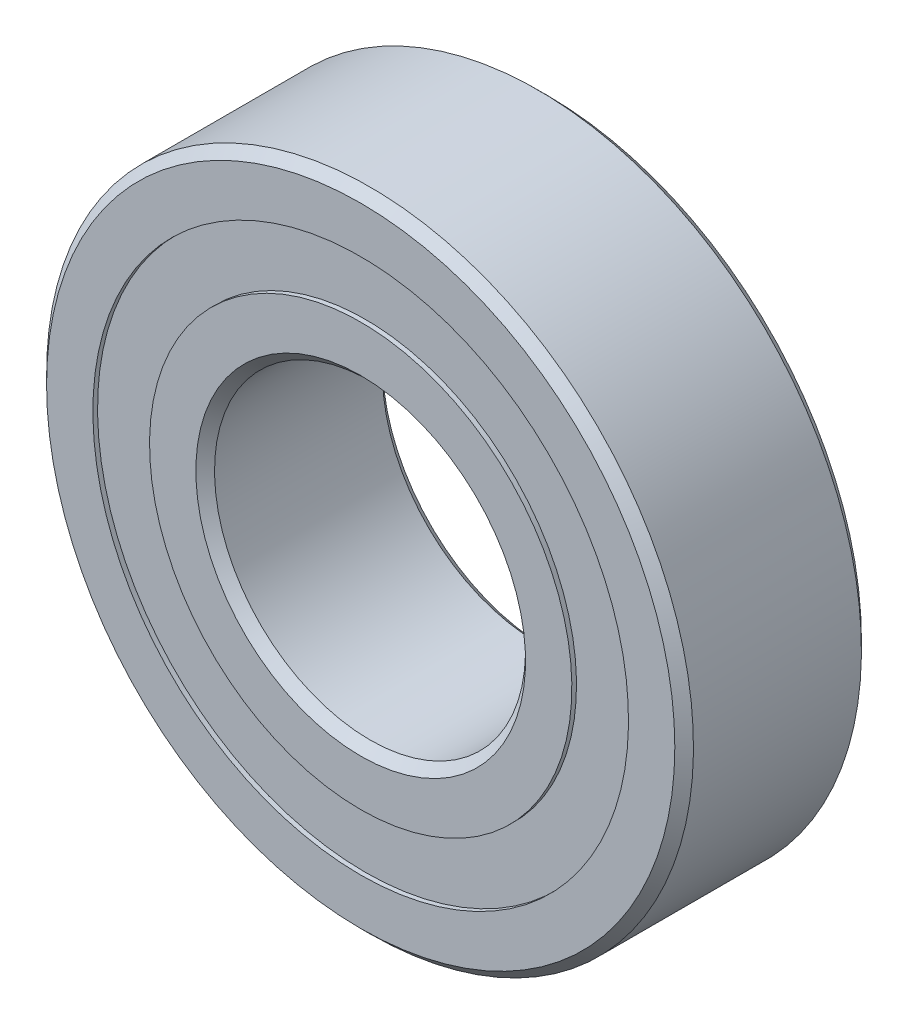
ISO-10303-21;
HEADER;
FILE_DESCRIPTION(('STEP AP214'),'2;1');
FILE_NAME('part.step','',(''),(''),'','','');
FILE_SCHEMA(('AUTOMOTIVE_DESIGN { 1 0 10303 214 1 1 1 1 }'));
ENDSEC;
DATA;
#1=APPLICATION_CONTEXT('core data for automotive mechanical design processes');
#2=APPLICATION_PROTOCOL_DEFINITION('international standard','automotive_design',2000,#1);
#3=PRODUCT_CONTEXT('',#1,'mechanical');
#4=PRODUCT('Part','Part','',(#3));
#5=PRODUCT_RELATED_PRODUCT_CATEGORY('part','',(#4));
#6=PRODUCT_DEFINITION_FORMATION('','',#4);
#7=PRODUCT_DEFINITION_CONTEXT('part definition',#1,'design');
#8=PRODUCT_DEFINITION('design','',#6,#7);
#9=PRODUCT_DEFINITION_SHAPE('','',#8);
#10=(LENGTH_UNIT() NAMED_UNIT(*) SI_UNIT(.MILLI.,.METRE.));
#11=(NAMED_UNIT(*) PLANE_ANGLE_UNIT() SI_UNIT($,.RADIAN.));
#12=(NAMED_UNIT(*) SI_UNIT($,.STERADIAN.) SOLID_ANGLE_UNIT());
#13=UNCERTAINTY_MEASURE_WITH_UNIT(LENGTH_MEASURE(1.E-05),#10,'distance_accuracy_value','');
#14=(GEOMETRIC_REPRESENTATION_CONTEXT(3) GLOBAL_UNCERTAINTY_ASSIGNED_CONTEXT((#13)) GLOBAL_UNIT_ASSIGNED_CONTEXT((#10,
#11,#12)) REPRESENTATION_CONTEXT('',''));
#15=CARTESIAN_POINT('',(0.,0.,0.));
#16=DIRECTION('',(0.,0.,1.));
#17=DIRECTION('',(1.,0.,0.));
#18=AXIS2_PLACEMENT_3D('',#15,#16,#17);
#19=CARTESIAN_POINT('',(0.,21.5269230769231,-7.125));
#20=DIRECTION('',(0.,0.,1.));
#21=DIRECTION('',(0.,-1.,0.));
#22=AXIS2_PLACEMENT_3D('',#19,#20,#21);
#23=PLANE('',#22);
#24=CARTESIAN_POINT('',(0.,0.,-7.125));
#25=DIRECTION('',(0.,0.,1.));
#26=DIRECTION('',(0.,-1.,0.));
#27=AXIS2_PLACEMENT_3D('',#24,#25,#26);
#28=CIRCLE('',#27,21.5269230769231);
#29=CARTESIAN_POINT('',(0.,-21.5269230769231,-7.12500000000001));
#30=VERTEX_POINT('',#29);
#31=EDGE_CURVE('E57',#30,#30,#28,.T.);
#32=ORIENTED_EDGE('',*,*,#31,.F.);
#33=EDGE_LOOP('',(#32));
#34=FACE_BOUND('',#33,.T.);
#35=CARTESIAN_POINT('',(0.,0.,-7.125));
#36=DIRECTION('',(0.,0.,1.));
#37=DIRECTION('',(0.,-1.,0.));
#38=AXIS2_PLACEMENT_3D('',#35,#36,#37);
#39=CIRCLE('',#38,16.9730769230769);
#40=CARTESIAN_POINT('',(0.,-16.9730769230769,-7.12500000000001));
#41=VERTEX_POINT('',#40);
#42=EDGE_CURVE('E11',#41,#41,#39,.T.);
#43=ORIENTED_EDGE('',*,*,#42,.T.);
#44=EDGE_LOOP('',(#43));
#45=FACE_BOUND('',#44,.T.);
#46=ADVANCED_FACE('F43',(#34,#45),#23,.F.);
#47=CARTESIAN_POINT('',(0.,0.,7.5));
#48=DIRECTION('',(0.,0.,1.));
#49=DIRECTION('',(0.,-1.,0.));
#50=AXIS2_PLACEMENT_3D('',#47,#48,#49);
#51=CYLINDRICAL_SURFACE('',#50,16.9730769230769);
#52=ORIENTED_EDGE('',*,*,#42,.F.);
#53=EDGE_LOOP('',(#52));
#54=FACE_BOUND('',#53,.T.);
#55=CARTESIAN_POINT('',(0.,0.,-4.03676724735722));
#56=DIRECTION('',(0.,0.,1.));
#57=DIRECTION('',(0.,-1.,0.));
#58=AXIS2_PLACEMENT_3D('',#55,#56,#57);
#59=CIRCLE('',#58,16.9730769230769);
#60=CARTESIAN_POINT('',(0.,-16.9730769230769,-4.03676724735722));
#61=VERTEX_POINT('',#60);
#62=EDGE_CURVE('E49',#61,#61,#59,.T.);
#63=ORIENTED_EDGE('',*,*,#62,.T.);
#64=EDGE_LOOP('',(#63));
#65=FACE_BOUND('',#64,.T.);
#66=ADVANCED_FACE('F66',(#54,#65),#51,.F.);
#67=CARTESIAN_POINT('',(0.,21.5269230769231,-4.03676724735722));
#68=DIRECTION('',(0.,0.,-1.));
#69=DIRECTION('',(0.,1.,0.));
#70=AXIS2_PLACEMENT_3D('',#67,#68,#69);
#71=PLANE('',#70);
#72=ORIENTED_EDGE('',*,*,#62,.F.);
#73=EDGE_LOOP('',(#72));
#74=FACE_BOUND('',#73,.T.);
#75=CARTESIAN_POINT('',(0.,0.,-4.03676724735722));
#76=DIRECTION('',(0.,0.,1.));
#77=DIRECTION('',(0.,-1.,0.));
#78=AXIS2_PLACEMENT_3D('',#75,#76,#77);
#79=CIRCLE('',#78,21.5269230769231);
#80=CARTESIAN_POINT('',(0.,-21.5269230769231,-4.03676724735723));
#81=VERTEX_POINT('',#80);
#82=EDGE_CURVE('E53',#81,#81,#79,.T.);
#83=ORIENTED_EDGE('',*,*,#82,.T.);
#84=EDGE_LOOP('',(#83));
#85=FACE_BOUND('',#84,.T.);
#86=ADVANCED_FACE('F70',(#74,#85),#71,.F.);
#87=CARTESIAN_POINT('',(0.,0.,7.5));
#88=DIRECTION('',(0.,0.,1.));
#89=DIRECTION('',(0.,-1.,0.));
#90=AXIS2_PLACEMENT_3D('',#87,#88,#89);
#91=CYLINDRICAL_SURFACE('',#90,21.5269230769231);
#92=ORIENTED_EDGE('',*,*,#82,.F.);
#93=EDGE_LOOP('',(#92));
#94=FACE_BOUND('',#93,.T.);
#95=ORIENTED_EDGE('',*,*,#31,.T.);
#96=EDGE_LOOP('',(#95));
#97=FACE_BOUND('',#96,.T.);
#98=ADVANCED_FACE('F63',(#94,#97),#91,.T.);
#99=CLOSED_SHELL('',(#46,#66,#86,#98));
#100=MANIFOLD_SOLID_BREP('B2',#99);
#101=CARTESIAN_POINT('',(0.,21.5269230769231,7.125));
#102=DIRECTION('',(0.,0.,-1.));
#103=DIRECTION('',(0.,1.,0.));
#104=AXIS2_PLACEMENT_3D('',#101,#102,#103);
#105=PLANE('',#104);
#106=CARTESIAN_POINT('',(0.,0.,7.125));
#107=DIRECTION('',(0.,0.,1.));
#108=DIRECTION('',(0.,-1.,0.));
#109=AXIS2_PLACEMENT_3D('',#106,#107,#108);
#110=CIRCLE('',#109,16.9730769230769);
#111=CARTESIAN_POINT('',(0.,-16.9730769230769,7.12499999999999));
#112=VERTEX_POINT('',#111);
#113=EDGE_CURVE('E42',#112,#112,#110,.T.);
#114=ORIENTED_EDGE('',*,*,#113,.F.);
#115=EDGE_LOOP('',(#114));
#116=FACE_BOUND('',#115,.T.);
#117=CARTESIAN_POINT('',(0.,0.,7.125));
#118=DIRECTION('',(0.,0.,1.));
#119=DIRECTION('',(0.,-1.,0.));
#120=AXIS2_PLACEMENT_3D('',#117,#118,#119);
#121=CIRCLE('',#120,21.5269230769231);
#122=CARTESIAN_POINT('',(0.,-21.5269230769231,7.12499999999999));
#123=VERTEX_POINT('',#122);
#124=EDGE_CURVE('E138',#123,#123,#121,.T.);
#125=ORIENTED_EDGE('',*,*,#124,.T.);
#126=EDGE_LOOP('',(#125));
#127=FACE_BOUND('',#126,.T.);
#128=ADVANCED_FACE('F124',(#116,#127),#105,.F.);
#129=CARTESIAN_POINT('',(0.,0.,7.5));
#130=DIRECTION('',(0.,0.,1.));
#131=DIRECTION('',(0.,-1.,0.));
#132=AXIS2_PLACEMENT_3D('',#129,#130,#131);
#133=CYLINDRICAL_SURFACE('',#132,16.9730769230769);
#134=CARTESIAN_POINT('',(0.,0.,4.03676724735722));
#135=DIRECTION('',(0.,0.,1.));
#136=DIRECTION('',(0.,-1.,0.));
#137=AXIS2_PLACEMENT_3D('',#134,#135,#136);
#138=CIRCLE('',#137,16.9730769230769);
#139=CARTESIAN_POINT('',(0.,-16.9730769230769,4.03676724735721));
#140=VERTEX_POINT('',#139);
#141=EDGE_CURVE('E130',#140,#140,#138,.T.);
#142=ORIENTED_EDGE('',*,*,#141,.F.);
#143=EDGE_LOOP('',(#142));
#144=FACE_BOUND('',#143,.T.);
#145=ORIENTED_EDGE('',*,*,#113,.T.);
#146=EDGE_LOOP('',(#145));
#147=FACE_BOUND('',#146,.T.);
#148=ADVANCED_FACE('F153',(#144,#147),#133,.F.);
#149=CARTESIAN_POINT('',(0.,21.5269230769231,4.03676724735722));
#150=DIRECTION('',(0.,0.,1.));
#151=DIRECTION('',(0.,-1.,0.));
#152=AXIS2_PLACEMENT_3D('',#149,#150,#151);
#153=PLANE('',#152);
#154=CARTESIAN_POINT('',(0.,0.,4.03676724735722));
#155=DIRECTION('',(0.,0.,1.));
#156=DIRECTION('',(0.,-1.,0.));
#157=AXIS2_PLACEMENT_3D('',#154,#155,#156);
#158=CIRCLE('',#157,21.5269230769231);
#159=CARTESIAN_POINT('',(0.,-21.5269230769231,4.03676724735721));
#160=VERTEX_POINT('',#159);
#161=EDGE_CURVE('E134',#160,#160,#158,.T.);
#162=ORIENTED_EDGE('',*,*,#161,.F.);
#163=EDGE_LOOP('',(#162));
#164=FACE_BOUND('',#163,.T.);
#165=ORIENTED_EDGE('',*,*,#141,.T.);
#166=EDGE_LOOP('',(#165));
#167=FACE_BOUND('',#166,.T.);
#168=ADVANCED_FACE('F148',(#164,#167),#153,.F.);
#169=CARTESIAN_POINT('',(0.,0.,7.5));
#170=DIRECTION('',(0.,0.,1.));
#171=DIRECTION('',(0.,-1.,0.));
#172=AXIS2_PLACEMENT_3D('',#169,#170,#171);
#173=CYLINDRICAL_SURFACE('',#172,21.5269230769231);
#174=ORIENTED_EDGE('',*,*,#124,.F.);
#175=EDGE_LOOP('',(#174));
#176=FACE_BOUND('',#175,.T.);
#177=ORIENTED_EDGE('',*,*,#161,.T.);
#178=EDGE_LOOP('',(#177));
#179=FACE_BOUND('',#178,.T.);
#180=ADVANCED_FACE('F145',(#176,#179),#173,.T.);
#181=CLOSED_SHELL('',(#128,#148,#168,#180));
#182=MANIFOLD_SOLID_BREP('B6',#181);
#183=CARTESIAN_POINT('',(-12.3736614864657,14.7463555300405,0.));
#184=DIRECTION('',(0.,0.,1.));
#185=DIRECTION('',(-0.64278760968653,0.766044443118986,0.));
#186=AXIS2_PLACEMENT_3D('',#183,#184,#185);
#187=SPHERICAL_SURFACE('',#186,4.03676724735722);
#188=CARTESIAN_POINT('',(-12.3736614864657,14.7463555300405,4.03676724735722));
#189=VERTEX_POINT('',#188);
#190=VERTEX_LOOP('',#189);
#191=FACE_BOUND('',#190,.T.);
#192=ADVANCED_FACE('F205',(#191),#187,.T.);
#193=CLOSED_SHELL('',(#192));
#194=MANIFOLD_SOLID_BREP('B37',#193);
#195=CARTESIAN_POINT('',(-18.957549245485,3.3427274200886,0.));
#196=DIRECTION('',(0.,0.,1.));
#197=DIRECTION('',(-0.984807753012206,0.17364817766694,0.));
#198=AXIS2_PLACEMENT_3D('',#195,#196,#197);
#199=SPHERICAL_SURFACE('',#198,4.03676724735722);
#200=CARTESIAN_POINT('',(-18.957549245485,3.3427274200886,4.03676724735722));
#201=VERTEX_POINT('',#200);
#202=VERTEX_LOOP('',#201);
#203=FACE_BOUND('',#202,.T.);
#204=ADVANCED_FACE('F223',(#203),#199,.T.);
#205=CLOSED_SHELL('',(#204));
#206=MANIFOLD_SOLID_BREP('B120',#205);
#207=CARTESIAN_POINT('',(-16.6709890228505,-9.62499999999985,0.));
#208=DIRECTION('',(0.,0.,1.));
#209=DIRECTION('',(-0.866025403784443,-0.499999999999992,0.));
#210=AXIS2_PLACEMENT_3D('',#207,#208,#209);
#211=SPHERICAL_SURFACE('',#210,4.03676724735722);
#212=CARTESIAN_POINT('',(-16.6709890228505,-9.62499999999985,4.03676724735721));
#213=VERTEX_POINT('',#212);
#214=VERTEX_LOOP('',#213);
#215=FACE_BOUND('',#214,.T.);
#216=ADVANCED_FACE('F241',(#215),#211,.T.);
#217=CLOSED_SHELL('',(#216));
#218=MANIFOLD_SOLID_BREP('B201',#217);
#219=CARTESIAN_POINT('',(-6.58388775901926,-18.0890829501287,0.));
#220=DIRECTION('',(0.,0.,1.));
#221=DIRECTION('',(-0.342020143325676,-0.939692620785906,0.));
#222=AXIS2_PLACEMENT_3D('',#219,#220,#221);
#223=SPHERICAL_SURFACE('',#222,4.03676724735722);
#224=CARTESIAN_POINT('',(-6.58388775901926,-18.0890829501287,4.03676724735721));
#225=VERTEX_POINT('',#224);
#226=VERTEX_LOOP('',#225);
#227=FACE_BOUND('',#226,.T.);
#228=ADVANCED_FACE('F259',(#227),#223,.T.);
#229=CLOSED_SHELL('',(#228));
#230=MANIFOLD_SOLID_BREP('B219',#229);
#231=CARTESIAN_POINT('',(6.58388775901902,-18.0890829501288,0.));
#232=DIRECTION('',(0.,0.,1.));
#233=DIRECTION('',(0.342020143325663,-0.939692620785911,0.));
#234=AXIS2_PLACEMENT_3D('',#231,#232,#233);
#235=SPHERICAL_SURFACE('',#234,4.03676724735722);
#236=CARTESIAN_POINT('',(6.58388775901902,-18.0890829501288,4.03676724735721));
#237=VERTEX_POINT('',#236);
#238=VERTEX_LOOP('',#237);
#239=FACE_BOUND('',#238,.T.);
#240=ADVANCED_FACE('F277',(#239),#235,.T.);
#241=CLOSED_SHELL('',(#240));
#242=MANIFOLD_SOLID_BREP('B237',#241);
#243=CARTESIAN_POINT('',(16.6709890228504,-9.62500000000008,0.));
#244=DIRECTION('',(0.,0.,1.));
#245=DIRECTION('',(0.866025403784436,-0.500000000000004,0.));
#246=AXIS2_PLACEMENT_3D('',#243,#244,#245);
#247=SPHERICAL_SURFACE('',#246,4.03676724735722);
#248=CARTESIAN_POINT('',(16.6709890228504,-9.62500000000008,4.03676724735721));
#249=VERTEX_POINT('',#248);
#250=VERTEX_LOOP('',#249);
#251=FACE_BOUND('',#250,.T.);
#252=ADVANCED_FACE('F295',(#251),#247,.T.);
#253=CLOSED_SHELL('',(#252));
#254=MANIFOLD_SOLID_BREP('B255',#253);
#255=CARTESIAN_POINT('',(18.957549245485,3.34272742008835,0.));
#256=DIRECTION('',(0.,0.,1.));
#257=DIRECTION('',(0.984807753012209,0.173648177666927,0.));
#258=AXIS2_PLACEMENT_3D('',#255,#256,#257);
#259=SPHERICAL_SURFACE('',#258,4.03676724735722);
#260=CARTESIAN_POINT('',(18.957549245485,3.34272742008835,4.03676724735722));
#261=VERTEX_POINT('',#260);
#262=VERTEX_LOOP('',#261);
#263=FACE_BOUND('',#262,.T.);
#264=ADVANCED_FACE('F313',(#263),#259,.T.);
#265=CLOSED_SHELL('',(#264));
#266=MANIFOLD_SOLID_BREP('B273',#265);
#267=CARTESIAN_POINT('',(12.3736614864659,14.7463555300403,0.));
#268=DIRECTION('',(0.,0.,1.));
#269=DIRECTION('',(0.642787609686541,0.766044443118977,0.));
#270=AXIS2_PLACEMENT_3D('',#267,#268,#269);
#271=SPHERICAL_SURFACE('',#270,4.03676724735722);
#272=CARTESIAN_POINT('',(12.3736614864659,14.7463555300403,4.03676724735722));
#273=VERTEX_POINT('',#272);
#274=VERTEX_LOOP('',#273);
#275=FACE_BOUND('',#274,.T.);
#276=ADVANCED_FACE('F331',(#275),#271,.T.);
#277=CLOSED_SHELL('',(#276));
#278=MANIFOLD_SOLID_BREP('B291',#277);
#279=CARTESIAN_POINT('',(0.,19.25,0.));
#280=DIRECTION('',(0.,0.,1.));
#281=DIRECTION('',(0.,1.,0.));
#282=AXIS2_PLACEMENT_3D('',#279,#280,#281);
#283=SPHERICAL_SURFACE('',#282,4.03676724735722);
#284=CARTESIAN_POINT('',(0.,19.25,4.03676724735722));
#285=VERTEX_POINT('',#284);
#286=VERTEX_LOOP('',#285);
#287=FACE_BOUND('',#286,.T.);
#288=ADVANCED_FACE('F351',(#287),#283,.T.);
#289=CLOSED_SHELL('',(#288));
#290=MANIFOLD_SOLID_BREP('B309',#289);
#291=CARTESIAN_POINT('',(0.,13.25,7.50000000000001));
#292=DIRECTION('',(0.,0.,-1.));
#293=DIRECTION('',(0.,1.,0.));
#294=AXIS2_PLACEMENT_3D('',#291,#292,#293);
#295=PLANE('',#294);
#296=CARTESIAN_POINT('',(0.,0.,7.50000000000001));
#297=DIRECTION('',(0.,0.,1.));
#298=DIRECTION('',(0.,-1.,0.));
#299=AXIS2_PLACEMENT_3D('',#296,#297,#298);
#300=CIRCLE('',#299,13.25);
#301=CARTESIAN_POINT('',(0.,-13.25,7.5));
#302=VERTEX_POINT('',#301);
#303=EDGE_CURVE('E398',#302,#302,#300,.T.);
#304=ORIENTED_EDGE('',*,*,#303,.F.);
#305=EDGE_LOOP('',(#304));
#306=FACE_BOUND('',#305,.T.);
#307=CARTESIAN_POINT('',(0.,0.,7.50000000000001));
#308=DIRECTION('',(0.,0.,1.));
#309=DIRECTION('',(0.,-1.,0.));
#310=AXIS2_PLACEMENT_3D('',#307,#308,#309);
#311=CIRCLE('',#310,16.9730769230769);
#312=CARTESIAN_POINT('',(0.,-16.9730769230769,7.5));
#313=VERTEX_POINT('',#312);
#314=EDGE_CURVE('E350',#313,#313,#311,.T.);
#315=ORIENTED_EDGE('',*,*,#314,.T.);
#316=EDGE_LOOP('',(#315));
#317=FACE_BOUND('',#316,.T.);
#318=ADVANCED_FACE('F370',(#306,#317),#295,.F.);
#319=CARTESIAN_POINT('',(0.,0.,7.5));
#320=DIRECTION('',(0.,0.,1.));
#321=DIRECTION('',(0.,-1.,0.));
#322=AXIS2_PLACEMENT_3D('',#319,#320,#321);
#323=CYLINDRICAL_SURFACE('',#322,16.9730769230769);
#324=ORIENTED_EDGE('',*,*,#314,.F.);
#325=EDGE_LOOP('',(#324));
#326=FACE_BOUND('',#325,.T.);
#327=CARTESIAN_POINT('',(0.,0.,3.33333333333332));
#328=DIRECTION('',(0.,0.,1.));
#329=DIRECTION('',(0.,-1.,0.));
#330=AXIS2_PLACEMENT_3D('',#327,#328,#329);
#331=CIRCLE('',#330,16.9730769230769);
#332=CARTESIAN_POINT('',(0.,-16.9730769230769,3.33333333333332));
#333=VERTEX_POINT('',#332);
#334=EDGE_CURVE('E376',#333,#333,#331,.T.);
#335=ORIENTED_EDGE('',*,*,#334,.T.);
#336=EDGE_LOOP('',(#335));
#337=FACE_BOUND('',#336,.T.);
#338=ADVANCED_FACE('F405',(#326,#337),#323,.T.);
#339=CARTESIAN_POINT('',(0.,0.,0.));
#340=DIRECTION('',(0.,0.,1.));
#341=DIRECTION('',(0.,-1.,0.));
#342=AXIS2_PLACEMENT_3D('',#339,#340,#341);
#343=TOROIDAL_SURFACE('',#342,19.25,4.03676724735722);
#344=ORIENTED_EDGE('',*,*,#334,.F.);
#345=EDGE_LOOP('',(#344));
#346=FACE_BOUND('',#345,.T.);
#347=CARTESIAN_POINT('',(0.,0.,-3.33333333333333));
#348=DIRECTION('',(0.,0.,1.));
#349=DIRECTION('',(0.,-1.,0.));
#350=AXIS2_PLACEMENT_3D('',#347,#348,#349);
#351=CIRCLE('',#350,16.9730769230769);
#352=CARTESIAN_POINT('',(0.,-16.9730769230769,-3.33333333333333));
#353=VERTEX_POINT('',#352);
#354=EDGE_CURVE('E380',#353,#353,#351,.T.);
#355=ORIENTED_EDGE('',*,*,#354,.T.);
#356=EDGE_LOOP('',(#355));
#357=FACE_BOUND('',#356,.T.);
#358=ADVANCED_FACE('F409',(#346,#357),#343,.F.);
#359=CARTESIAN_POINT('',(0.,0.,7.5));
#360=DIRECTION('',(0.,0.,1.));
#361=DIRECTION('',(0.,-1.,0.));
#362=AXIS2_PLACEMENT_3D('',#359,#360,#361);
#363=CYLINDRICAL_SURFACE('',#362,16.9730769230769);
#364=ORIENTED_EDGE('',*,*,#354,.F.);
#365=EDGE_LOOP('',(#364));
#366=FACE_BOUND('',#365,.T.);
#367=CARTESIAN_POINT('',(0.,0.,-7.50000000000001));
#368=DIRECTION('',(0.,0.,1.));
#369=DIRECTION('',(0.,-1.,0.));
#370=AXIS2_PLACEMENT_3D('',#367,#368,#369);
#371=CIRCLE('',#370,16.9730769230769);
#372=CARTESIAN_POINT('',(0.,-16.9730769230769,-7.50000000000002));
#373=VERTEX_POINT('',#372);
#374=EDGE_CURVE('E384',#373,#373,#371,.T.);
#375=ORIENTED_EDGE('',*,*,#374,.T.);
#376=EDGE_LOOP('',(#375));
#377=FACE_BOUND('',#376,.T.);
#378=ADVANCED_FACE('F414',(#366,#377),#363,.T.);
#379=CARTESIAN_POINT('',(0.,13.25,-7.50000000000001));
#380=DIRECTION('',(0.,0.,1.));
#381=DIRECTION('',(0.,-1.,0.));
#382=AXIS2_PLACEMENT_3D('',#379,#380,#381);
#383=PLANE('',#382);
#384=ORIENTED_EDGE('',*,*,#374,.F.);
#385=EDGE_LOOP('',(#384));
#386=FACE_BOUND('',#385,.T.);
#387=CARTESIAN_POINT('',(0.,0.,-7.50000000000001));
#388=DIRECTION('',(0.,0.,1.));
#389=DIRECTION('',(0.,-1.,0.));
#390=AXIS2_PLACEMENT_3D('',#387,#388,#389);
#391=CIRCLE('',#390,13.25);
#392=CARTESIAN_POINT('',(0.,-13.25,-7.50000000000001));
#393=VERTEX_POINT('',#392);
#394=EDGE_CURVE('E389',#393,#393,#391,.T.);
#395=ORIENTED_EDGE('',*,*,#394,.T.);
#396=EDGE_LOOP('',(#395));
#397=FACE_BOUND('',#396,.T.);
#398=ADVANCED_FACE('F420',(#386,#397),#383,.F.);
#399=CARTESIAN_POINT('',(0.,0.,-6.75));
#400=DIRECTION('',(0.,0.,-1.));
#401=DIRECTION('',(0.,1.,0.));
#402=AXIS2_PLACEMENT_3D('',#399,#400,#401);
#403=CONICAL_SURFACE('',#402,12.5,0.785398163397428);
#404=ORIENTED_EDGE('',*,*,#394,.F.);
#405=EDGE_LOOP('',(#404));
#406=FACE_BOUND('',#405,.T.);
#407=CARTESIAN_POINT('',(0.,0.,-6.75));
#408=DIRECTION('',(0.,0.,1.));
#409=DIRECTION('',(0.,-1.,0.));
#410=AXIS2_PLACEMENT_3D('',#407,#408,#409);
#411=CIRCLE('',#410,12.5);
#412=CARTESIAN_POINT('',(0.,-12.5,-6.75));
#413=VERTEX_POINT('',#412);
#414=EDGE_CURVE('E392',#413,#413,#411,.T.);
#415=ORIENTED_EDGE('',*,*,#414,.T.);
#416=EDGE_LOOP('',(#415));
#417=FACE_BOUND('',#416,.T.);
#418=ADVANCED_FACE('F424',(#406,#417),#403,.F.);
#419=CARTESIAN_POINT('',(0.,0.,7.5));
#420=DIRECTION('',(0.,0.,1.));
#421=DIRECTION('',(0.,-1.,0.));
#422=AXIS2_PLACEMENT_3D('',#419,#420,#421);
#423=CYLINDRICAL_SURFACE('',#422,12.5);
#424=ORIENTED_EDGE('',*,*,#414,.F.);
#425=EDGE_LOOP('',(#424));
#426=FACE_BOUND('',#425,.T.);
#427=CARTESIAN_POINT('',(0.,0.,6.75));
#428=DIRECTION('',(0.,0.,1.));
#429=DIRECTION('',(0.,-1.,0.));
#430=AXIS2_PLACEMENT_3D('',#427,#428,#429);
#431=CIRCLE('',#430,12.5);
#432=CARTESIAN_POINT('',(0.,-12.5,6.74999999999999));
#433=VERTEX_POINT('',#432);
#434=EDGE_CURVE('E395',#433,#433,#431,.T.);
#435=ORIENTED_EDGE('',*,*,#434,.T.);
#436=EDGE_LOOP('',(#435));
#437=FACE_BOUND('',#436,.T.);
#438=ADVANCED_FACE('F428',(#426,#437),#423,.F.);
#439=CARTESIAN_POINT('',(0.,0.,7.50000000000001));
#440=DIRECTION('',(0.,0.,1.));
#441=DIRECTION('',(0.,-1.,0.));
#442=AXIS2_PLACEMENT_3D('',#439,#440,#441);
#443=CONICAL_SURFACE('',#442,13.25,0.785398163397428);
#444=ORIENTED_EDGE('',*,*,#434,.F.);
#445=EDGE_LOOP('',(#444));
#446=FACE_BOUND('',#445,.T.);
#447=ORIENTED_EDGE('',*,*,#303,.T.);
#448=EDGE_LOOP('',(#447));
#449=FACE_BOUND('',#448,.T.);
#450=ADVANCED_FACE('F402',(#446,#449),#443,.F.);
#451=CLOSED_SHELL('',(#318,#338,#358,#378,#398,#418,#438,#450));
#452=MANIFOLD_SOLID_BREP('B327',#451);
#453=CARTESIAN_POINT('',(0.,0.,7.5));
#454=DIRECTION('',(0.,0.,1.));
#455=DIRECTION('',(0.,-1.,0.));
#456=AXIS2_PLACEMENT_3D('',#453,#454,#455);
#457=CYLINDRICAL_SURFACE('',#456,26.);
#458=CARTESIAN_POINT('',(0.,0.,6.75));
#459=DIRECTION('',(0.,0.,1.));
#460=DIRECTION('',(0.,-1.,0.));
#461=AXIS2_PLACEMENT_3D('',#458,#459,#460);
#462=CIRCLE('',#461,26.);
#463=CARTESIAN_POINT('',(0.,-26.,6.74999999999999));
#464=VERTEX_POINT('',#463);
#465=EDGE_CURVE('E369',#464,#464,#462,.T.);
#466=ORIENTED_EDGE('',*,*,#465,.F.);
#467=EDGE_LOOP('',(#466));
#468=FACE_BOUND('',#467,.T.);
#469=CARTESIAN_POINT('',(0.,0.,-6.75));
#470=DIRECTION('',(0.,0.,1.));
#471=DIRECTION('',(0.,-1.,0.));
#472=AXIS2_PLACEMENT_3D('',#469,#470,#471);
#473=CIRCLE('',#472,26.);
#474=CARTESIAN_POINT('',(0.,-26.,-6.75000000000001));
#475=VERTEX_POINT('',#474);
#476=EDGE_CURVE('E519',#475,#475,#473,.T.);
#477=ORIENTED_EDGE('',*,*,#476,.T.);
#478=EDGE_LOOP('',(#477));
#479=FACE_BOUND('',#478,.T.);
#480=ADVANCED_FACE('F491',(#468,#479),#457,.T.);
#481=CARTESIAN_POINT('',(0.,0.,6.75));
#482=DIRECTION('',(0.,0.,-1.));
#483=DIRECTION('',(0.,1.,0.));
#484=AXIS2_PLACEMENT_3D('',#481,#482,#483);
#485=CONICAL_SURFACE('',#484,26.,0.785398163397444);
#486=CARTESIAN_POINT('',(0.,0.,7.5));
#487=DIRECTION('',(0.,0.,1.));
#488=DIRECTION('',(0.,-1.,0.));
#489=AXIS2_PLACEMENT_3D('',#486,#487,#488);
#490=CIRCLE('',#489,25.25);
#491=CARTESIAN_POINT('',(0.,-25.25,7.49999999999999));
#492=VERTEX_POINT('',#491);
#493=EDGE_CURVE('E497',#492,#492,#490,.T.);
#494=ORIENTED_EDGE('',*,*,#493,.F.);
#495=EDGE_LOOP('',(#494));
#496=FACE_BOUND('',#495,.T.);
#497=ORIENTED_EDGE('',*,*,#465,.T.);
#498=EDGE_LOOP('',(#497));
#499=FACE_BOUND('',#498,.T.);
#500=ADVANCED_FACE('F556',(#496,#499),#485,.T.);
#501=CARTESIAN_POINT('',(0.,25.25,7.5));
#502=DIRECTION('',(0.,0.,-1.));
#503=DIRECTION('',(0.,1.,0.));
#504=AXIS2_PLACEMENT_3D('',#501,#502,#503);
#505=PLANE('',#504);
#506=CARTESIAN_POINT('',(0.,0.,7.5));
#507=DIRECTION('',(0.,0.,1.));
#508=DIRECTION('',(0.,-1.,0.));
#509=AXIS2_PLACEMENT_3D('',#506,#507,#508);
#510=CIRCLE('',#509,21.5269230769231);
#511=CARTESIAN_POINT('',(0.,-21.5269230769231,7.49999999999999));
#512=VERTEX_POINT('',#511);
#513=EDGE_CURVE('E501',#512,#512,#510,.T.);
#514=ORIENTED_EDGE('',*,*,#513,.F.);
#515=EDGE_LOOP('',(#514));
#516=FACE_BOUND('',#515,.T.);
#517=ORIENTED_EDGE('',*,*,#493,.T.);
#518=EDGE_LOOP('',(#517));
#519=FACE_BOUND('',#518,.T.);
#520=ADVANCED_FACE('F551',(#516,#519),#505,.F.);
#521=CARTESIAN_POINT('',(0.,0.,7.5));
#522=DIRECTION('',(0.,0.,1.));
#523=DIRECTION('',(0.,-1.,0.));
#524=AXIS2_PLACEMENT_3D('',#521,#522,#523);
#525=CYLINDRICAL_SURFACE('',#524,21.5269230769231);
#526=CARTESIAN_POINT('',(0.,0.,3.33333333333333));
#527=DIRECTION('',(0.,0.,1.));
#528=DIRECTION('',(0.,-1.,0.));
#529=AXIS2_PLACEMENT_3D('',#526,#527,#528);
#530=CIRCLE('',#529,21.5269230769231);
#531=CARTESIAN_POINT('',(0.,-21.5269230769231,3.33333333333333));
#532=VERTEX_POINT('',#531);
#533=EDGE_CURVE('E505',#532,#532,#530,.T.);
#534=ORIENTED_EDGE('',*,*,#533,.F.);
#535=EDGE_LOOP('',(#534));
#536=FACE_BOUND('',#535,.T.);
#537=ORIENTED_EDGE('',*,*,#513,.T.);
#538=EDGE_LOOP('',(#537));
#539=FACE_BOUND('',#538,.T.);
#540=ADVANCED_FACE('F545',(#536,#539),#525,.F.);
#541=CARTESIAN_POINT('',(0.,0.,0.));
#542=DIRECTION('',(0.,0.,1.));
#543=DIRECTION('',(0.,-1.,0.));
#544=AXIS2_PLACEMENT_3D('',#541,#542,#543);
#545=TOROIDAL_SURFACE('',#544,19.25,4.03676724735722);
#546=CARTESIAN_POINT('',(0.,0.,-3.33333333333333));
#547=DIRECTION('',(0.,0.,1.));
#548=DIRECTION('',(0.,-1.,0.));
#549=AXIS2_PLACEMENT_3D('',#546,#547,#548);
#550=CIRCLE('',#549,21.5269230769231);
#551=CARTESIAN_POINT('',(0.,-21.5269230769231,-3.33333333333334));
#552=VERTEX_POINT('',#551);
#553=EDGE_CURVE('E510',#552,#552,#550,.T.);
#554=ORIENTED_EDGE('',*,*,#553,.F.);
#555=EDGE_LOOP('',(#554));
#556=FACE_BOUND('',#555,.T.);
#557=ORIENTED_EDGE('',*,*,#533,.T.);
#558=EDGE_LOOP('',(#557));
#559=FACE_BOUND('',#558,.T.);
#560=ADVANCED_FACE('F539',(#556,#559),#545,.F.);
#561=CARTESIAN_POINT('',(0.,0.,7.5));
#562=DIRECTION('',(0.,0.,1.));
#563=DIRECTION('',(0.,-1.,0.));
#564=AXIS2_PLACEMENT_3D('',#561,#562,#563);
#565=CYLINDRICAL_SURFACE('',#564,21.5269230769231);
#566=CARTESIAN_POINT('',(0.,0.,-7.50000000000001));
#567=DIRECTION('',(0.,0.,1.));
#568=DIRECTION('',(0.,-1.,0.));
#569=AXIS2_PLACEMENT_3D('',#566,#567,#568);
#570=CIRCLE('',#569,21.5269230769231);
#571=CARTESIAN_POINT('',(0.,-21.5269230769231,-7.50000000000001));
#572=VERTEX_POINT('',#571);
#573=EDGE_CURVE('E513',#572,#572,#570,.T.);
#574=ORIENTED_EDGE('',*,*,#573,.F.);
#575=EDGE_LOOP('',(#574));
#576=FACE_BOUND('',#575,.T.);
#577=ORIENTED_EDGE('',*,*,#553,.T.);
#578=EDGE_LOOP('',(#577));
#579=FACE_BOUND('',#578,.T.);
#580=ADVANCED_FACE('F533',(#576,#579),#565,.F.);
#581=CARTESIAN_POINT('',(0.,25.25,-7.5));
#582=DIRECTION('',(0.,0.,1.));
#583=DIRECTION('',(0.,-1.,0.));
#584=AXIS2_PLACEMENT_3D('',#581,#582,#583);
#585=PLANE('',#584);
#586=CARTESIAN_POINT('',(0.,0.,-7.50000000000001));
#587=DIRECTION('',(0.,0.,1.));
#588=DIRECTION('',(0.,-1.,0.));
#589=AXIS2_PLACEMENT_3D('',#586,#587,#588);
#590=CIRCLE('',#589,25.25);
#591=CARTESIAN_POINT('',(0.,-25.25,-7.50000000000001));
#592=VERTEX_POINT('',#591);
#593=EDGE_CURVE('E516',#592,#592,#590,.T.);
#594=ORIENTED_EDGE('',*,*,#593,.F.);
#595=EDGE_LOOP('',(#594));
#596=FACE_BOUND('',#595,.T.);
#597=ORIENTED_EDGE('',*,*,#573,.T.);
#598=EDGE_LOOP('',(#597));
#599=FACE_BOUND('',#598,.T.);
#600=ADVANCED_FACE('F527',(#596,#599),#585,.F.);
#601=CARTESIAN_POINT('',(0.,0.,-7.50000000000001));
#602=DIRECTION('',(0.,0.,1.));
#603=DIRECTION('',(0.,-1.,0.));
#604=AXIS2_PLACEMENT_3D('',#601,#602,#603);
#605=CONICAL_SURFACE('',#604,25.25,0.785398163397442);
#606=ORIENTED_EDGE('',*,*,#476,.F.);
#607=EDGE_LOOP('',(#606));
#608=FACE_BOUND('',#607,.T.);
#609=ORIENTED_EDGE('',*,*,#593,.T.);
#610=EDGE_LOOP('',(#609));
#611=FACE_BOUND('',#610,.T.);
#612=ADVANCED_FACE('F524',(#608,#611),#605,.T.);
#613=CLOSED_SHELL('',(#480,#500,#520,#540,#560,#580,#600,#612));
#614=MANIFOLD_SOLID_BREP('B345',#613);
#615=ADVANCED_BREP_SHAPE_REPRESENTATION('',(#18,#100,#182,#194,#206,#218,#230,#242,#254,#266,
#278,#290,#452,#614),#14);
#616=SHAPE_DEFINITION_REPRESENTATION(#9,#615);
ENDSEC;
END-ISO-10303-21;
